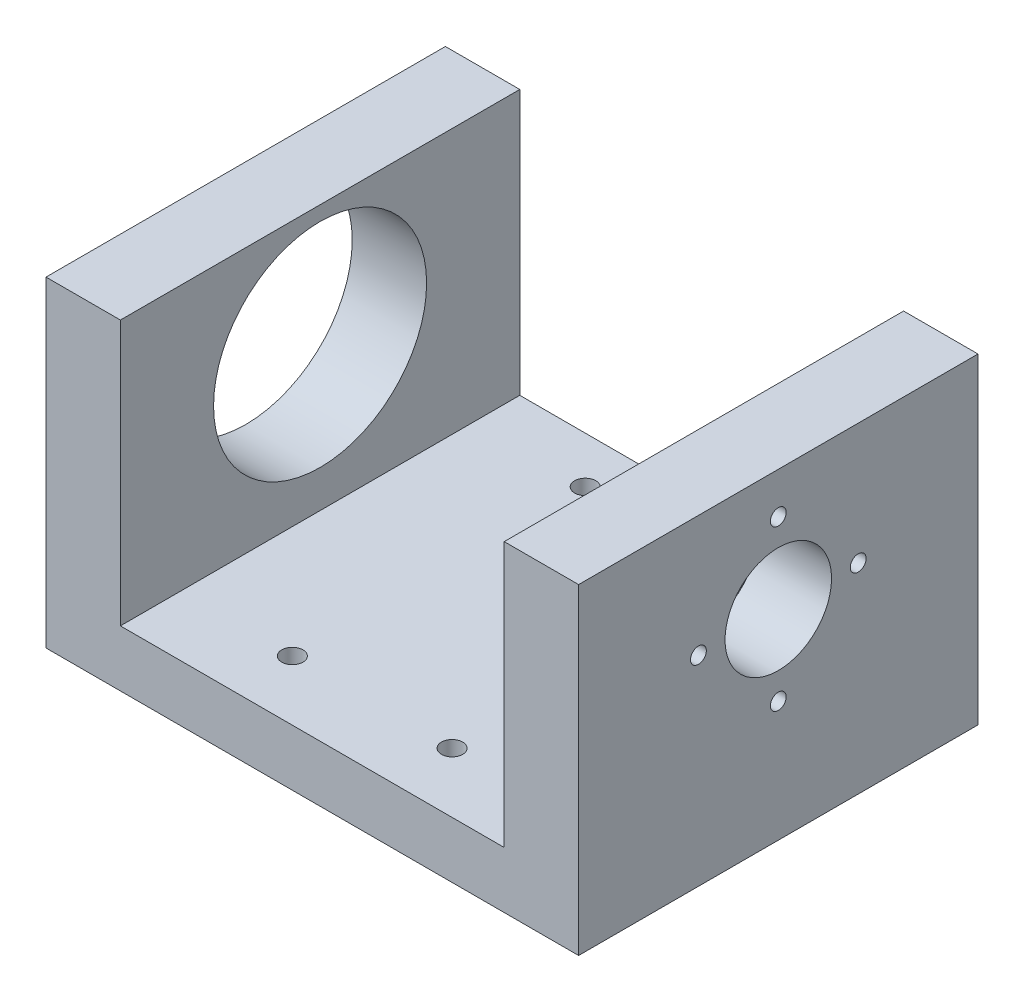
ISO-10303-21;
HEADER;
FILE_DESCRIPTION(('STEP AP214'),'2;1');
FILE_NAME('part.step','',(''),(''),'','','');
FILE_SCHEMA(('AUTOMOTIVE_DESIGN { 1 0 10303 214 1 1 1 1 }'));
ENDSEC;
DATA;
#1=APPLICATION_CONTEXT('core data for automotive mechanical design processes');
#2=APPLICATION_PROTOCOL_DEFINITION('international standard','automotive_design',2000,#1);
#3=PRODUCT_CONTEXT('',#1,'mechanical');
#4=PRODUCT('Part','Part','',(#3));
#5=PRODUCT_RELATED_PRODUCT_CATEGORY('part','',(#4));
#6=PRODUCT_DEFINITION_FORMATION('','',#4);
#7=PRODUCT_DEFINITION_CONTEXT('part definition',#1,'design');
#8=PRODUCT_DEFINITION('design','',#6,#7);
#9=PRODUCT_DEFINITION_SHAPE('','',#8);
#10=(LENGTH_UNIT() NAMED_UNIT(*) SI_UNIT(.MILLI.,.METRE.));
#11=(NAMED_UNIT(*) PLANE_ANGLE_UNIT() SI_UNIT($,.RADIAN.));
#12=(NAMED_UNIT(*) SI_UNIT($,.STERADIAN.) SOLID_ANGLE_UNIT());
#13=UNCERTAINTY_MEASURE_WITH_UNIT(LENGTH_MEASURE(1.E-05),#10,'distance_accuracy_value','');
#14=(GEOMETRIC_REPRESENTATION_CONTEXT(3) GLOBAL_UNCERTAINTY_ASSIGNED_CONTEXT((#13)) GLOBAL_UNIT_ASSIGNED_CONTEXT((#10,
#11,#12)) REPRESENTATION_CONTEXT('',''));
#15=CARTESIAN_POINT('',(0.,0.,0.));
#16=DIRECTION('',(0.,0.,1.));
#17=DIRECTION('',(1.,0.,0.));
#18=AXIS2_PLACEMENT_3D('',#15,#16,#17);
#19=CARTESIAN_POINT('',(23.3517849925234,14.8878504672897,30.));
#20=DIRECTION('',(-1.,0.,0.));
#21=DIRECTION('',(0.,0.,1.));
#22=AXIS2_PLACEMENT_3D('',#19,#20,#21);
#23=PLANE('',#22);
#24=CARTESIAN_POINT('',(23.3517849925234,5.79465046728972,15.));
#25=DIRECTION('',(1.,0.,0.));
#26=DIRECTION('',(0.,0.,-1.));
#27=AXIS2_PLACEMENT_3D('',#24,#25,#26);
#28=CIRCLE('',#27,4.);
#29=CARTESIAN_POINT('',(23.3517849925234,5.79465046728972,11.));
#30=VERTEX_POINT('',#29);
#31=EDGE_CURVE('E308',#30,#30,#28,.T.);
#32=ORIENTED_EDGE('',*,*,#31,.F.);
#33=EDGE_LOOP('',(#32));
#34=FACE_BOUND('',#33,.T.);
#35=DIRECTION('',(0.,1.,0.));
#36=VECTOR('',#35,1.);
#37=CARTESIAN_POINT('',(23.3517849925234,14.8878504672897,0.));
#38=LINE('',#37,#36);
#39=CARTESIAN_POINT('',(23.3517849925234,-9.24214953271028,0.));
#40=VERTEX_POINT('',#39);
#41=CARTESIAN_POINT('',(23.3517849925234,14.8878504672897,0.));
#42=VERTEX_POINT('',#41);
#43=EDGE_CURVE('E128',#40,#42,#38,.T.);
#44=ORIENTED_EDGE('',*,*,#43,.T.);
#45=DIRECTION('',(0.,0.,-1.));
#46=VECTOR('',#45,1.);
#47=CARTESIAN_POINT('',(23.3517849925234,14.8878504672897,30.));
#48=LINE('',#47,#46);
#49=CARTESIAN_POINT('',(23.3517849925234,14.8878504672897,30.));
#50=VERTEX_POINT('',#49);
#51=EDGE_CURVE('E138',#50,#42,#48,.T.);
#52=ORIENTED_EDGE('',*,*,#51,.F.);
#53=DIRECTION('',(0.,1.,0.));
#54=VECTOR('',#53,1.);
#55=CARTESIAN_POINT('',(23.3517849925234,14.8878504672897,30.));
#56=LINE('',#55,#54);
#57=CARTESIAN_POINT('',(23.3517849925234,-9.24214953271028,30.));
#58=VERTEX_POINT('',#57);
#59=EDGE_CURVE('E186',#58,#50,#56,.T.);
#60=ORIENTED_EDGE('',*,*,#59,.F.);
#61=DIRECTION('',(0.,0.,-1.));
#62=VECTOR('',#61,1.);
#63=CARTESIAN_POINT('',(23.3517849925234,-9.24214953271028,30.));
#64=LINE('',#63,#62);
#65=EDGE_CURVE('E45',#58,#40,#64,.T.);
#66=ORIENTED_EDGE('',*,*,#65,.T.);
#67=EDGE_LOOP('',(#44,#52,#60,#66));
#68=FACE_BOUND('',#67,.T.);
#69=CARTESIAN_POINT('',(23.3517849925234,5.79465046728972,21.));
#70=DIRECTION('',(1.,0.,0.));
#71=DIRECTION('',(0.,0.,-1.));
#72=AXIS2_PLACEMENT_3D('',#69,#70,#71);
#73=CIRCLE('',#72,0.595629999999988);
#74=CARTESIAN_POINT('',(23.3517849925234,5.79465046728972,20.40437));
#75=VERTEX_POINT('',#74);
#76=EDGE_CURVE('E302',#75,#75,#73,.T.);
#77=ORIENTED_EDGE('',*,*,#76,.F.);
#78=EDGE_LOOP('',(#77));
#79=FACE_BOUND('',#78,.T.);
#80=CARTESIAN_POINT('',(23.3517849925234,-0.205349532710281,15.));
#81=DIRECTION('',(1.,0.,0.));
#82=DIRECTION('',(0.,0.,-1.));
#83=AXIS2_PLACEMENT_3D('',#80,#81,#82);
#84=CIRCLE('',#83,0.595629999999988);
#85=CARTESIAN_POINT('',(23.3517849925234,-0.205349532710281,14.40437));
#86=VERTEX_POINT('',#85);
#87=EDGE_CURVE('E296',#86,#86,#84,.T.);
#88=ORIENTED_EDGE('',*,*,#87,.F.);
#89=EDGE_LOOP('',(#88));
#90=FACE_BOUND('',#89,.T.);
#91=CARTESIAN_POINT('',(23.3517849925234,5.79465046728972,9.));
#92=DIRECTION('',(1.,0.,0.));
#93=DIRECTION('',(0.,0.,-1.));
#94=AXIS2_PLACEMENT_3D('',#91,#92,#93);
#95=CIRCLE('',#94,0.595629999999988);
#96=CARTESIAN_POINT('',(23.3517849925234,5.79465046728972,8.40437000000001));
#97=VERTEX_POINT('',#96);
#98=EDGE_CURVE('E288',#97,#97,#95,.T.);
#99=ORIENTED_EDGE('',*,*,#98,.F.);
#100=EDGE_LOOP('',(#99));
#101=FACE_BOUND('',#100,.T.);
#102=CARTESIAN_POINT('',(23.3517849925234,11.7946504672897,15.));
#103=DIRECTION('',(1.,0.,0.));
#104=DIRECTION('',(0.,0.,-1.));
#105=AXIS2_PLACEMENT_3D('',#102,#103,#104);
#106=CIRCLE('',#105,0.595629999999988);
#107=CARTESIAN_POINT('',(23.3517849925234,11.7946504672897,14.40437));
#108=VERTEX_POINT('',#107);
#109=EDGE_CURVE('E285',#108,#108,#106,.T.);
#110=ORIENTED_EDGE('',*,*,#109,.F.);
#111=EDGE_LOOP('',(#110));
#112=FACE_BOUND('',#111,.T.);
#113=ADVANCED_FACE('F36',(#34,#68,#79,#90,#101,#112),#23,.F.);
#114=CARTESIAN_POINT('',(-16.6542056074766,14.8878504672897,30.));
#115=DIRECTION('',(0.,-1.,0.));
#116=DIRECTION('',(0.,0.,-1.));
#117=AXIS2_PLACEMENT_3D('',#114,#115,#116);
#118=PLANE('',#117);
#119=DIRECTION('',(-1.,0.,0.));
#120=VECTOR('',#119,1.);
#121=CARTESIAN_POINT('',(-16.6542056074766,14.8878504672897,0.));
#122=LINE('',#121,#120);
#123=CARTESIAN_POINT('',(17.7637849925234,14.8878504672897,0.));
#124=VERTEX_POINT('',#123);
#125=EDGE_CURVE('E127',#42,#124,#122,.T.);
#126=ORIENTED_EDGE('',*,*,#125,.T.);
#127=DIRECTION('',(0.,0.,1.));
#128=VECTOR('',#127,1.);
#129=CARTESIAN_POINT('',(17.7637849925234,14.8878504672897,0.));
#130=LINE('',#129,#128);
#131=CARTESIAN_POINT('',(17.7637849925234,14.8878504672897,30.));
#132=VERTEX_POINT('',#131);
#133=EDGE_CURVE('E178',#124,#132,#130,.T.);
#134=ORIENTED_EDGE('',*,*,#133,.T.);
#135=DIRECTION('',(-1.,0.,0.));
#136=VECTOR('',#135,1.);
#137=CARTESIAN_POINT('',(-16.6542056074766,14.8878504672897,30.));
#138=LINE('',#137,#136);
#139=EDGE_CURVE('E139',#50,#132,#138,.T.);
#140=ORIENTED_EDGE('',*,*,#139,.F.);
#141=ORIENTED_EDGE('',*,*,#51,.T.);
#142=EDGE_LOOP('',(#126,#134,#140,#141));
#143=FACE_BOUND('',#142,.T.);
#144=ADVANCED_FACE('F200',(#143),#118,.F.);
#145=CARTESIAN_POINT('',(-16.6542056074766,14.8878504672897,30.));
#146=DIRECTION('',(1.,0.,0.));
#147=DIRECTION('',(0.,1.,0.));
#148=AXIS2_PLACEMENT_3D('',#145,#146,#147);
#149=PLANE('',#148);
#150=CARTESIAN_POINT('',(-16.6542056074766,5.79465046728972,15.));
#151=DIRECTION('',(-1.,0.,0.));
#152=DIRECTION('',(0.,-1.,0.));
#153=AXIS2_PLACEMENT_3D('',#150,#151,#152);
#154=CIRCLE('',#153,8.001);
#155=CARTESIAN_POINT('',(-16.6542056074766,-2.20634953271028,15.));
#156=VERTEX_POINT('',#155);
#157=EDGE_CURVE('E314',#156,#156,#154,.T.);
#158=ORIENTED_EDGE('',*,*,#157,.F.);
#159=EDGE_LOOP('',(#158));
#160=FACE_BOUND('',#159,.T.);
#161=DIRECTION('',(0.,-1.,0.));
#162=VECTOR('',#161,1.);
#163=CARTESIAN_POINT('',(-16.6542056074766,14.8878504672897,0.));
#164=LINE('',#163,#162);
#165=CARTESIAN_POINT('',(-16.6542056074766,14.8878504672897,0.));
#166=VERTEX_POINT('',#165);
#167=CARTESIAN_POINT('',(-16.6542056074766,-9.24214953271028,0.));
#168=VERTEX_POINT('',#167);
#169=EDGE_CURVE('E126',#166,#168,#164,.T.);
#170=ORIENTED_EDGE('',*,*,#169,.T.);
#171=DIRECTION('',(0.,0.,-1.));
#172=VECTOR('',#171,1.);
#173=CARTESIAN_POINT('',(-16.6542056074766,-9.24214953271028,30.));
#174=LINE('',#173,#172);
#175=CARTESIAN_POINT('',(-16.6542056074766,-9.24214953271028,30.));
#176=VERTEX_POINT('',#175);
#177=EDGE_CURVE('E11',#176,#168,#174,.T.);
#178=ORIENTED_EDGE('',*,*,#177,.F.);
#179=DIRECTION('',(0.,-1.,0.));
#180=VECTOR('',#179,1.);
#181=CARTESIAN_POINT('',(-16.6542056074766,14.8878504672897,30.));
#182=LINE('',#181,#180);
#183=CARTESIAN_POINT('',(-16.6542056074766,14.8878504672897,30.));
#184=VERTEX_POINT('',#183);
#185=EDGE_CURVE('E131',#184,#176,#182,.T.);
#186=ORIENTED_EDGE('',*,*,#185,.F.);
#187=DIRECTION('',(0.,0.,-1.));
#188=VECTOR('',#187,1.);
#189=CARTESIAN_POINT('',(-16.6542056074766,14.8878504672897,30.));
#190=LINE('',#189,#188);
#191=EDGE_CURVE('E136',#184,#166,#190,.T.);
#192=ORIENTED_EDGE('',*,*,#191,.T.);
#193=EDGE_LOOP('',(#170,#178,#186,#192));
#194=FACE_BOUND('',#193,.T.);
#195=ADVANCED_FACE('F38',(#160,#194),#149,.F.);
#196=CARTESIAN_POINT('',(-16.6542056074766,-9.24214953271028,30.));
#197=DIRECTION('',(0.,1.,0.));
#198=DIRECTION('',(0.,0.,1.));
#199=AXIS2_PLACEMENT_3D('',#196,#197,#198);
#200=PLANE('',#199);
#201=CARTESIAN_POINT('',(-2.65121030747663,-9.24214953271028,3.5));
#202=DIRECTION('',(0.,-1.,0.));
#203=DIRECTION('',(1.,0.,0.));
#204=AXIS2_PLACEMENT_3D('',#201,#202,#203);
#205=CIRCLE('',#204,0.800000000000001);
#206=CARTESIAN_POINT('',(-1.85121030747663,-9.24214953271028,3.5));
#207=VERTEX_POINT('',#206);
#208=EDGE_CURVE('E164',#207,#207,#205,.T.);
#209=ORIENTED_EDGE('',*,*,#208,.F.);
#210=EDGE_LOOP('',(#209));
#211=FACE_BOUND('',#210,.T.);
#212=CARTESIAN_POINT('',(9.34878969252337,-9.24214953271028,3.5));
#213=DIRECTION('',(0.,-1.,0.));
#214=DIRECTION('',(1.,0.,0.));
#215=AXIS2_PLACEMENT_3D('',#212,#213,#214);
#216=CIRCLE('',#215,0.800000000000001);
#217=CARTESIAN_POINT('',(10.1487896925234,-9.24214953271028,3.5));
#218=VERTEX_POINT('',#217);
#219=EDGE_CURVE('E154',#218,#218,#216,.T.);
#220=ORIENTED_EDGE('',*,*,#219,.F.);
#221=EDGE_LOOP('',(#220));
#222=FACE_BOUND('',#221,.T.);
#223=CARTESIAN_POINT('',(9.34878969252337,-9.24214953271028,25.5));
#224=DIRECTION('',(0.,-1.,0.));
#225=DIRECTION('',(1.,0.,0.));
#226=AXIS2_PLACEMENT_3D('',#223,#224,#225);
#227=CIRCLE('',#226,0.799999999999999);
#228=CARTESIAN_POINT('',(10.1487896925234,-9.24214953271028,25.5));
#229=VERTEX_POINT('',#228);
#230=EDGE_CURVE('E151',#229,#229,#227,.T.);
#231=ORIENTED_EDGE('',*,*,#230,.F.);
#232=EDGE_LOOP('',(#231));
#233=FACE_BOUND('',#232,.T.);
#234=CARTESIAN_POINT('',(-2.65121030747663,-9.24214953271028,25.5));
#235=DIRECTION('',(0.,-1.,0.));
#236=DIRECTION('',(1.,0.,0.));
#237=AXIS2_PLACEMENT_3D('',#234,#235,#236);
#238=CIRCLE('',#237,0.799999999999997);
#239=CARTESIAN_POINT('',(-1.85121030747663,-9.24214953271028,25.5));
#240=VERTEX_POINT('',#239);
#241=EDGE_CURVE('E148',#240,#240,#238,.T.);
#242=ORIENTED_EDGE('',*,*,#241,.F.);
#243=EDGE_LOOP('',(#242));
#244=FACE_BOUND('',#243,.T.);
#245=DIRECTION('',(1.,0.,0.));
#246=VECTOR('',#245,1.);
#247=CARTESIAN_POINT('',(-16.6542056074766,-9.24214953271028,0.));
#248=LINE('',#247,#246);
#249=EDGE_CURVE('E132',#168,#40,#248,.T.);
#250=ORIENTED_EDGE('',*,*,#249,.T.);
#251=ORIENTED_EDGE('',*,*,#65,.F.);
#252=DIRECTION('',(1.,0.,0.));
#253=VECTOR('',#252,1.);
#254=CARTESIAN_POINT('',(-16.6542056074766,-9.24214953271028,30.));
#255=LINE('',#254,#253);
#256=EDGE_CURVE('E91',#176,#58,#255,.T.);
#257=ORIENTED_EDGE('',*,*,#256,.F.);
#258=ORIENTED_EDGE('',*,*,#177,.T.);
#259=EDGE_LOOP('',(#250,#251,#257,#258));
#260=FACE_BOUND('',#259,.T.);
#261=ADVANCED_FACE('F190',(#211,#222,#233,#244,#260),#200,.F.);
#262=CARTESIAN_POINT('',(-11.0662056074766,14.8878504672897,30.));
#263=VERTEX_POINT('',#262);
#264=EDGE_CURVE('E62',#263,#184,#138,.T.);
#265=ORIENTED_EDGE('',*,*,#264,.F.);
#266=DIRECTION('',(0.,0.,1.));
#267=VECTOR('',#266,1.);
#268=CARTESIAN_POINT('',(-11.0662056074766,14.8878504672897,0.));
#269=LINE('',#268,#267);
#270=CARTESIAN_POINT('',(-11.0662056074766,14.8878504672897,0.));
#271=VERTEX_POINT('',#270);
#272=EDGE_CURVE('E115',#271,#263,#269,.T.);
#273=ORIENTED_EDGE('',*,*,#272,.F.);
#274=EDGE_CURVE('E84',#271,#166,#122,.T.);
#275=ORIENTED_EDGE('',*,*,#274,.T.);
#276=ORIENTED_EDGE('',*,*,#191,.F.);
#277=EDGE_LOOP('',(#265,#273,#275,#276));
#278=FACE_BOUND('',#277,.T.);
#279=ADVANCED_FACE('F120',(#278),#118,.F.);
#280=CARTESIAN_POINT('',(0.,0.,30.));
#281=DIRECTION('',(0.,0.,1.));
#282=DIRECTION('',(1.,0.,0.));
#283=AXIS2_PLACEMENT_3D('',#280,#281,#282);
#284=PLANE('',#283);
#285=DIRECTION('',(0.,1.,0.));
#286=VECTOR('',#285,1.);
#287=CARTESIAN_POINT('',(17.7637849925234,14.8878504672897,30.));
#288=LINE('',#287,#286);
#289=CARTESIAN_POINT('',(17.7637849925234,-5.00881619937695,30.));
#290=VERTEX_POINT('',#289);
#291=EDGE_CURVE('E118',#290,#132,#288,.T.);
#292=ORIENTED_EDGE('',*,*,#291,.F.);
#293=DIRECTION('',(1.,0.,0.));
#294=VECTOR('',#293,1.);
#295=CARTESIAN_POINT('',(17.7637849925234,-5.00881619937695,30.));
#296=LINE('',#295,#294);
#297=CARTESIAN_POINT('',(-11.0662056074766,-5.00881619937695,30.));
#298=VERTEX_POINT('',#297);
#299=EDGE_CURVE('E174',#298,#290,#296,.T.);
#300=ORIENTED_EDGE('',*,*,#299,.F.);
#301=DIRECTION('',(0.,-1.,0.));
#302=VECTOR('',#301,1.);
#303=CARTESIAN_POINT('',(-11.0662056074766,-5.00881619937695,30.));
#304=LINE('',#303,#302);
#305=EDGE_CURVE('E147',#263,#298,#304,.T.);
#306=ORIENTED_EDGE('',*,*,#305,.F.);
#307=ORIENTED_EDGE('',*,*,#264,.T.);
#308=ORIENTED_EDGE('',*,*,#185,.T.);
#309=ORIENTED_EDGE('',*,*,#256,.T.);
#310=ORIENTED_EDGE('',*,*,#59,.T.);
#311=ORIENTED_EDGE('',*,*,#139,.T.);
#312=EDGE_LOOP('',(#292,#300,#306,#307,#308,#309,#310,#311));
#313=FACE_BOUND('',#312,.T.);
#314=ADVANCED_FACE('F203',(#313),#284,.T.);
#315=CARTESIAN_POINT('',(0.,0.,0.));
#316=DIRECTION('',(0.,0.,1.));
#317=DIRECTION('',(1.,0.,0.));
#318=AXIS2_PLACEMENT_3D('',#315,#316,#317);
#319=PLANE('',#318);
#320=DIRECTION('',(1.,0.,0.));
#321=VECTOR('',#320,1.);
#322=CARTESIAN_POINT('',(17.7637849925234,-5.00881619937695,0.));
#323=LINE('',#322,#321);
#324=CARTESIAN_POINT('',(-11.0662056074766,-5.00881619937695,0.));
#325=VERTEX_POINT('',#324);
#326=CARTESIAN_POINT('',(17.7637849925234,-5.00881619937695,0.));
#327=VERTEX_POINT('',#326);
#328=EDGE_CURVE('E53',#325,#327,#323,.T.);
#329=ORIENTED_EDGE('',*,*,#328,.T.);
#330=DIRECTION('',(0.,1.,0.));
#331=VECTOR('',#330,1.);
#332=CARTESIAN_POINT('',(17.7637849925234,14.8878504672897,0.));
#333=LINE('',#332,#331);
#334=EDGE_CURVE('E121',#327,#124,#333,.T.);
#335=ORIENTED_EDGE('',*,*,#334,.T.);
#336=ORIENTED_EDGE('',*,*,#125,.F.);
#337=ORIENTED_EDGE('',*,*,#43,.F.);
#338=ORIENTED_EDGE('',*,*,#249,.F.);
#339=ORIENTED_EDGE('',*,*,#169,.F.);
#340=ORIENTED_EDGE('',*,*,#274,.F.);
#341=DIRECTION('',(0.,-1.,0.));
#342=VECTOR('',#341,1.);
#343=CARTESIAN_POINT('',(-11.0662056074766,-5.00881619937695,0.));
#344=LINE('',#343,#342);
#345=EDGE_CURVE('E112',#271,#325,#344,.T.);
#346=ORIENTED_EDGE('',*,*,#345,.T.);
#347=EDGE_LOOP('',(#329,#335,#336,#337,#338,#339,#340,#346));
#348=FACE_BOUND('',#347,.T.);
#349=ADVANCED_FACE('F124',(#348),#319,.F.);
#350=CARTESIAN_POINT('',(17.7637849925234,14.8878504672897,0.));
#351=DIRECTION('',(1.,0.,0.));
#352=DIRECTION('',(0.,0.,-1.));
#353=AXIS2_PLACEMENT_3D('',#350,#351,#352);
#354=PLANE('',#353);
#355=CARTESIAN_POINT('',(17.7637849925234,11.7946504672897,15.));
#356=DIRECTION('',(1.,0.,0.));
#357=DIRECTION('',(0.,0.,-1.));
#358=AXIS2_PLACEMENT_3D('',#355,#356,#357);
#359=CIRCLE('',#358,0.595629999999993);
#360=CARTESIAN_POINT('',(17.7637849925234,11.7946504672897,14.40437));
#361=VERTEX_POINT('',#360);
#362=EDGE_CURVE('E282',#361,#361,#359,.T.);
#363=ORIENTED_EDGE('',*,*,#362,.T.);
#364=EDGE_LOOP('',(#363));
#365=FACE_BOUND('',#364,.T.);
#366=CARTESIAN_POINT('',(17.7637849925234,5.79465046728972,9.));
#367=DIRECTION('',(1.,0.,0.));
#368=DIRECTION('',(0.,0.,-1.));
#369=AXIS2_PLACEMENT_3D('',#366,#367,#368);
#370=CIRCLE('',#369,0.595629999999993);
#371=CARTESIAN_POINT('',(17.7637849925234,5.79465046728972,8.40437000000001));
#372=VERTEX_POINT('',#371);
#373=EDGE_CURVE('E293',#372,#372,#370,.T.);
#374=ORIENTED_EDGE('',*,*,#373,.T.);
#375=EDGE_LOOP('',(#374));
#376=FACE_BOUND('',#375,.T.);
#377=CARTESIAN_POINT('',(17.7637849925234,-0.205349532710281,15.));
#378=DIRECTION('',(1.,0.,0.));
#379=DIRECTION('',(0.,0.,-1.));
#380=AXIS2_PLACEMENT_3D('',#377,#378,#379);
#381=CIRCLE('',#380,0.595629999999993);
#382=CARTESIAN_POINT('',(17.7637849925234,-0.205349532710281,14.40437));
#383=VERTEX_POINT('',#382);
#384=EDGE_CURVE('E299',#383,#383,#381,.T.);
#385=ORIENTED_EDGE('',*,*,#384,.T.);
#386=EDGE_LOOP('',(#385));
#387=FACE_BOUND('',#386,.T.);
#388=CARTESIAN_POINT('',(17.7637849925234,5.79465046728972,21.));
#389=DIRECTION('',(1.,0.,0.));
#390=DIRECTION('',(0.,0.,-1.));
#391=AXIS2_PLACEMENT_3D('',#388,#389,#390);
#392=CIRCLE('',#391,0.595629999999993);
#393=CARTESIAN_POINT('',(17.7637849925234,5.79465046728972,20.40437));
#394=VERTEX_POINT('',#393);
#395=EDGE_CURVE('E305',#394,#394,#392,.T.);
#396=ORIENTED_EDGE('',*,*,#395,.T.);
#397=EDGE_LOOP('',(#396));
#398=FACE_BOUND('',#397,.T.);
#399=CARTESIAN_POINT('',(17.7637849925234,5.79465046728972,15.));
#400=DIRECTION('',(1.,0.,0.));
#401=DIRECTION('',(0.,0.,-1.));
#402=AXIS2_PLACEMENT_3D('',#399,#400,#401);
#403=CIRCLE('',#402,4.);
#404=CARTESIAN_POINT('',(17.7637849925234,5.79465046728972,11.));
#405=VERTEX_POINT('',#404);
#406=EDGE_CURVE('E311',#405,#405,#403,.F.);
#407=ORIENTED_EDGE('',*,*,#406,.F.);
#408=EDGE_LOOP('',(#407));
#409=FACE_BOUND('',#408,.T.);
#410=ORIENTED_EDGE('',*,*,#291,.T.);
#411=ORIENTED_EDGE('',*,*,#133,.F.);
#412=ORIENTED_EDGE('',*,*,#334,.F.);
#413=DIRECTION('',(0.,0.,1.));
#414=VECTOR('',#413,1.);
#415=CARTESIAN_POINT('',(17.7637849925234,-5.00881619937695,0.));
#416=LINE('',#415,#414);
#417=EDGE_CURVE('E181',#327,#290,#416,.T.);
#418=ORIENTED_EDGE('',*,*,#417,.T.);
#419=EDGE_LOOP('',(#410,#411,#412,#418));
#420=FACE_BOUND('',#419,.T.);
#421=ADVANCED_FACE('F226',(#365,#376,#387,#398,#409,#420),#354,.F.);
#422=CARTESIAN_POINT('',(17.7637849925234,-5.00881619937695,0.));
#423=DIRECTION('',(0.,-1.,0.));
#424=DIRECTION('',(0.,0.,-1.));
#425=AXIS2_PLACEMENT_3D('',#422,#423,#424);
#426=PLANE('',#425);
#427=CARTESIAN_POINT('',(-2.65121030747663,-5.00881619937695,3.5));
#428=DIRECTION('',(0.,-1.,0.));
#429=DIRECTION('',(0.,0.,-1.));
#430=AXIS2_PLACEMENT_3D('',#427,#428,#429);
#431=CIRCLE('',#430,0.800000000000001);
#432=CARTESIAN_POINT('',(-2.65121030747663,-5.00881619937695,2.7));
#433=VERTEX_POINT('',#432);
#434=EDGE_CURVE('E40',#433,#433,#431,.T.);
#435=ORIENTED_EDGE('',*,*,#434,.T.);
#436=EDGE_LOOP('',(#435));
#437=FACE_BOUND('',#436,.T.);
#438=CARTESIAN_POINT('',(9.34878969252337,-5.00881619937695,3.5));
#439=DIRECTION('',(0.,-1.,0.));
#440=DIRECTION('',(0.,0.,-1.));
#441=AXIS2_PLACEMENT_3D('',#438,#439,#440);
#442=CIRCLE('',#441,0.800000000000001);
#443=CARTESIAN_POINT('',(9.34878969252337,-5.00881619937695,2.7));
#444=VERTEX_POINT('',#443);
#445=EDGE_CURVE('E152',#444,#444,#442,.T.);
#446=ORIENTED_EDGE('',*,*,#445,.T.);
#447=EDGE_LOOP('',(#446));
#448=FACE_BOUND('',#447,.T.);
#449=CARTESIAN_POINT('',(9.34878969252337,-5.00881619937695,25.5));
#450=DIRECTION('',(0.,-1.,0.));
#451=DIRECTION('',(0.,0.,-1.));
#452=AXIS2_PLACEMENT_3D('',#449,#450,#451);
#453=CIRCLE('',#452,0.799999999999999);
#454=CARTESIAN_POINT('',(9.34878969252337,-5.00881619937695,24.7));
#455=VERTEX_POINT('',#454);
#456=EDGE_CURVE('E149',#455,#455,#453,.T.);
#457=ORIENTED_EDGE('',*,*,#456,.T.);
#458=EDGE_LOOP('',(#457));
#459=FACE_BOUND('',#458,.T.);
#460=CARTESIAN_POINT('',(-2.65121030747663,-5.00881619937695,25.5));
#461=DIRECTION('',(0.,-1.,0.));
#462=DIRECTION('',(0.,0.,-1.));
#463=AXIS2_PLACEMENT_3D('',#460,#461,#462);
#464=CIRCLE('',#463,0.799999999999997);
#465=CARTESIAN_POINT('',(-2.65121030747663,-5.00881619937695,24.7));
#466=VERTEX_POINT('',#465);
#467=EDGE_CURVE('E144',#466,#466,#464,.T.);
#468=ORIENTED_EDGE('',*,*,#467,.T.);
#469=EDGE_LOOP('',(#468));
#470=FACE_BOUND('',#469,.T.);
#471=ORIENTED_EDGE('',*,*,#299,.T.);
#472=ORIENTED_EDGE('',*,*,#417,.F.);
#473=ORIENTED_EDGE('',*,*,#328,.F.);
#474=DIRECTION('',(0.,0.,1.));
#475=VECTOR('',#474,1.);
#476=CARTESIAN_POINT('',(-11.0662056074766,-5.00881619937695,0.));
#477=LINE('',#476,#475);
#478=EDGE_CURVE('E116',#325,#298,#477,.T.);
#479=ORIENTED_EDGE('',*,*,#478,.T.);
#480=EDGE_LOOP('',(#471,#472,#473,#479));
#481=FACE_BOUND('',#480,.T.);
#482=ADVANCED_FACE('F232',(#437,#448,#459,#470,#481),#426,.F.);
#483=CARTESIAN_POINT('',(-11.0662056074766,-5.00881619937695,0.));
#484=DIRECTION('',(-1.,0.,0.));
#485=DIRECTION('',(0.,-1.,0.));
#486=AXIS2_PLACEMENT_3D('',#483,#484,#485);
#487=PLANE('',#486);
#488=CARTESIAN_POINT('',(-11.0662056074766,5.79465046728972,15.));
#489=DIRECTION('',(-1.,0.,0.));
#490=DIRECTION('',(0.,-1.,0.));
#491=AXIS2_PLACEMENT_3D('',#488,#489,#490);
#492=CIRCLE('',#491,8.001);
#493=CARTESIAN_POINT('',(-11.0662056074766,-2.20634953271028,15.));
#494=VERTEX_POINT('',#493);
#495=EDGE_CURVE('E315',#494,#494,#492,.T.);
#496=ORIENTED_EDGE('',*,*,#495,.T.);
#497=EDGE_LOOP('',(#496));
#498=FACE_BOUND('',#497,.T.);
#499=ORIENTED_EDGE('',*,*,#305,.T.);
#500=ORIENTED_EDGE('',*,*,#478,.F.);
#501=ORIENTED_EDGE('',*,*,#345,.F.);
#502=ORIENTED_EDGE('',*,*,#272,.T.);
#503=EDGE_LOOP('',(#499,#500,#501,#502));
#504=FACE_BOUND('',#503,.T.);
#505=ADVANCED_FACE('F114',(#498,#504),#487,.F.);
#506=CARTESIAN_POINT('',(-2.65121030747663,20.7578504672897,25.5));
#507=DIRECTION('',(0.,-1.,0.));
#508=DIRECTION('',(1.,0.,0.));
#509=AXIS2_PLACEMENT_3D('',#506,#507,#508);
#510=CYLINDRICAL_SURFACE('',#509,0.799999999999997);
#511=ORIENTED_EDGE('',*,*,#241,.T.);
#512=EDGE_LOOP('',(#511));
#513=FACE_BOUND('',#512,.T.);
#514=ORIENTED_EDGE('',*,*,#467,.F.);
#515=EDGE_LOOP('',(#514));
#516=FACE_BOUND('',#515,.T.);
#517=ADVANCED_FACE('F231',(#513,#516),#510,.F.);
#518=CARTESIAN_POINT('',(9.34878969252337,20.7578504672897,25.5));
#519=DIRECTION('',(0.,-1.,0.));
#520=DIRECTION('',(1.,0.,0.));
#521=AXIS2_PLACEMENT_3D('',#518,#519,#520);
#522=CYLINDRICAL_SURFACE('',#521,0.799999999999999);
#523=ORIENTED_EDGE('',*,*,#230,.T.);
#524=EDGE_LOOP('',(#523));
#525=FACE_BOUND('',#524,.T.);
#526=ORIENTED_EDGE('',*,*,#456,.F.);
#527=EDGE_LOOP('',(#526));
#528=FACE_BOUND('',#527,.T.);
#529=ADVANCED_FACE('F242',(#525,#528),#522,.F.);
#530=CARTESIAN_POINT('',(9.34878969252337,20.7578504672897,3.5));
#531=DIRECTION('',(0.,-1.,0.));
#532=DIRECTION('',(1.,0.,0.));
#533=AXIS2_PLACEMENT_3D('',#530,#531,#532);
#534=CYLINDRICAL_SURFACE('',#533,0.800000000000001);
#535=ORIENTED_EDGE('',*,*,#219,.T.);
#536=EDGE_LOOP('',(#535));
#537=FACE_BOUND('',#536,.T.);
#538=ORIENTED_EDGE('',*,*,#445,.F.);
#539=EDGE_LOOP('',(#538));
#540=FACE_BOUND('',#539,.T.);
#541=ADVANCED_FACE('F246',(#537,#540),#534,.F.);
#542=CARTESIAN_POINT('',(-2.65121030747663,20.7578504672897,3.5));
#543=DIRECTION('',(0.,-1.,0.));
#544=DIRECTION('',(1.,0.,0.));
#545=AXIS2_PLACEMENT_3D('',#542,#543,#544);
#546=CYLINDRICAL_SURFACE('',#545,0.800000000000001);
#547=ORIENTED_EDGE('',*,*,#208,.T.);
#548=EDGE_LOOP('',(#547));
#549=FACE_BOUND('',#548,.T.);
#550=ORIENTED_EDGE('',*,*,#434,.F.);
#551=EDGE_LOOP('',(#550));
#552=FACE_BOUND('',#551,.T.);
#553=ADVANCED_FACE('F250',(#549,#552),#546,.F.);
#554=CARTESIAN_POINT('',(-11.0662056074766,5.79465046728972,15.));
#555=DIRECTION('',(-1.,0.,0.));
#556=DIRECTION('',(0.,-1.,0.));
#557=AXIS2_PLACEMENT_3D('',#554,#555,#556);
#558=CYLINDRICAL_SURFACE('',#557,8.001);
#559=ORIENTED_EDGE('',*,*,#495,.F.);
#560=EDGE_LOOP('',(#559));
#561=FACE_BOUND('',#560,.T.);
#562=ORIENTED_EDGE('',*,*,#157,.T.);
#563=EDGE_LOOP('',(#562));
#564=FACE_BOUND('',#563,.T.);
#565=ADVANCED_FACE('F253',(#561,#564),#558,.F.);
#566=CARTESIAN_POINT('',(6.45007649353861,5.79465046728972,15.));
#567=DIRECTION('',(1.,0.,0.));
#568=DIRECTION('',(0.,0.,-1.));
#569=AXIS2_PLACEMENT_3D('',#566,#567,#568);
#570=CYLINDRICAL_SURFACE('',#569,4.);
#571=ORIENTED_EDGE('',*,*,#406,.T.);
#572=EDGE_LOOP('',(#571));
#573=FACE_BOUND('',#572,.T.);
#574=ORIENTED_EDGE('',*,*,#31,.T.);
#575=EDGE_LOOP('',(#574));
#576=FACE_BOUND('',#575,.T.);
#577=ADVANCED_FACE('F257',(#573,#576),#570,.F.);
#578=CARTESIAN_POINT('',(23.3517849925234,5.79465046728972,21.));
#579=DIRECTION('',(1.,0.,0.));
#580=DIRECTION('',(0.,0.,-1.));
#581=AXIS2_PLACEMENT_3D('',#578,#579,#580);
#582=CYLINDRICAL_SURFACE('',#581,0.595629999999993);
#583=ORIENTED_EDGE('',*,*,#395,.F.);
#584=EDGE_LOOP('',(#583));
#585=FACE_BOUND('',#584,.T.);
#586=ORIENTED_EDGE('',*,*,#76,.T.);
#587=EDGE_LOOP('',(#586));
#588=FACE_BOUND('',#587,.T.);
#589=ADVANCED_FACE('F261',(#585,#588),#582,.F.);
#590=CARTESIAN_POINT('',(23.3517849925234,-0.205349532710281,15.));
#591=DIRECTION('',(1.,0.,0.));
#592=DIRECTION('',(0.,0.,-1.));
#593=AXIS2_PLACEMENT_3D('',#590,#591,#592);
#594=CYLINDRICAL_SURFACE('',#593,0.595629999999993);
#595=ORIENTED_EDGE('',*,*,#384,.F.);
#596=EDGE_LOOP('',(#595));
#597=FACE_BOUND('',#596,.T.);
#598=ORIENTED_EDGE('',*,*,#87,.T.);
#599=EDGE_LOOP('',(#598));
#600=FACE_BOUND('',#599,.T.);
#601=ADVANCED_FACE('F265',(#597,#600),#594,.F.);
#602=CARTESIAN_POINT('',(23.3517849925234,5.79465046728972,9.));
#603=DIRECTION('',(1.,0.,0.));
#604=DIRECTION('',(0.,0.,-1.));
#605=AXIS2_PLACEMENT_3D('',#602,#603,#604);
#606=CYLINDRICAL_SURFACE('',#605,0.595629999999993);
#607=ORIENTED_EDGE('',*,*,#373,.F.);
#608=EDGE_LOOP('',(#607));
#609=FACE_BOUND('',#608,.T.);
#610=ORIENTED_EDGE('',*,*,#98,.T.);
#611=EDGE_LOOP('',(#610));
#612=FACE_BOUND('',#611,.T.);
#613=ADVANCED_FACE('F269',(#609,#612),#606,.F.);
#614=CARTESIAN_POINT('',(23.3517849925234,11.7946504672897,15.));
#615=DIRECTION('',(1.,0.,0.));
#616=DIRECTION('',(0.,0.,-1.));
#617=AXIS2_PLACEMENT_3D('',#614,#615,#616);
#618=CYLINDRICAL_SURFACE('',#617,0.595629999999993);
#619=ORIENTED_EDGE('',*,*,#362,.F.);
#620=EDGE_LOOP('',(#619));
#621=FACE_BOUND('',#620,.T.);
#622=ORIENTED_EDGE('',*,*,#109,.T.);
#623=EDGE_LOOP('',(#622));
#624=FACE_BOUND('',#623,.T.);
#625=ADVANCED_FACE('F273',(#621,#624),#618,.F.);
#626=CLOSED_SHELL('',(#113,#144,#195,#261,#279,#314,#349,#421,#482,#505,#517,#529,#541,#553,
#565,#577,#589,#601,#613,#625));
#627=MANIFOLD_SOLID_BREP('B2',#626);
#628=ADVANCED_BREP_SHAPE_REPRESENTATION('',(#18,#627),#14);
#629=SHAPE_DEFINITION_REPRESENTATION(#9,#628);
ENDSEC;
END-ISO-10303-21;
